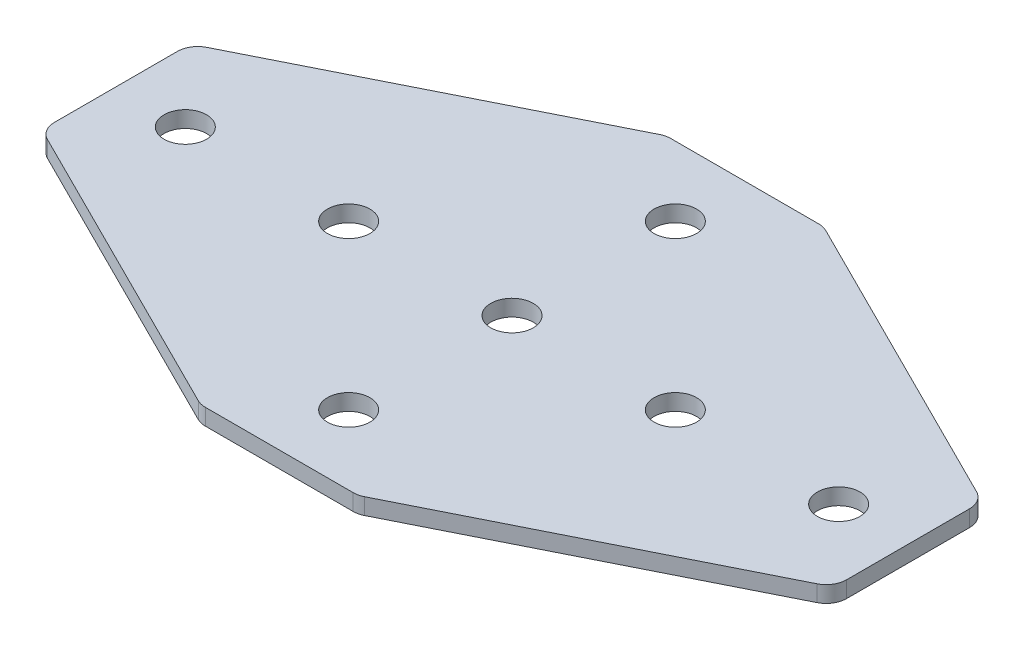
ISO-10303-21;
HEADER;
FILE_DESCRIPTION(('STEP AP214'),'2;1');
FILE_NAME('part.step','',(''),(''),'','','');
FILE_SCHEMA(('AUTOMOTIVE_DESIGN { 1 0 10303 214 1 1 1 1 }'));
ENDSEC;
DATA;
#1=APPLICATION_CONTEXT('core data for automotive mechanical design processes');
#2=APPLICATION_PROTOCOL_DEFINITION('international standard','automotive_design',2000,#1);
#3=PRODUCT_CONTEXT('',#1,'mechanical');
#4=PRODUCT('Part','Part','',(#3));
#5=PRODUCT_RELATED_PRODUCT_CATEGORY('part','',(#4));
#6=PRODUCT_DEFINITION_FORMATION('','',#4);
#7=PRODUCT_DEFINITION_CONTEXT('part definition',#1,'design');
#8=PRODUCT_DEFINITION('design','',#6,#7);
#9=PRODUCT_DEFINITION_SHAPE('','',#8);
#10=(LENGTH_UNIT() NAMED_UNIT(*) SI_UNIT(.MILLI.,.METRE.));
#11=(NAMED_UNIT(*) PLANE_ANGLE_UNIT() SI_UNIT($,.RADIAN.));
#12=(NAMED_UNIT(*) SI_UNIT($,.STERADIAN.) SOLID_ANGLE_UNIT());
#13=UNCERTAINTY_MEASURE_WITH_UNIT(LENGTH_MEASURE(1.E-05),#10,'distance_accuracy_value','');
#14=(GEOMETRIC_REPRESENTATION_CONTEXT(3) GLOBAL_UNCERTAINTY_ASSIGNED_CONTEXT((#13)) GLOBAL_UNIT_ASSIGNED_CONTEXT((#10,
#11,#12)) REPRESENTATION_CONTEXT('',''));
#15=CARTESIAN_POINT('',(0.,0.,0.));
#16=DIRECTION('',(0.,0.,1.));
#17=DIRECTION('',(1.,0.,0.));
#18=AXIS2_PLACEMENT_3D('',#15,#16,#17);
#19=CARTESIAN_POINT('',(-2.23293059684693,2.14126526075142,-0.907824161743065));
#20=DIRECTION('',(0.,-1.,0.));
#21=DIRECTION('',(0.,0.,-1.));
#22=AXIS2_PLACEMENT_3D('',#19,#20,#21);
#23=PLANE('',#22);
#24=CARTESIAN_POINT('',(-22.2329305968469,2.14126526075142,-0.90782416174305));
#25=DIRECTION('',(0.,-1.,0.));
#26=DIRECTION('',(0.,0.,1.));
#27=AXIS2_PLACEMENT_3D('',#24,#25,#26);
#28=CIRCLE('',#27,2.6);
#29=CARTESIAN_POINT('',(-22.2329305968469,2.14126526075142,1.69217583825695));
#30=VERTEX_POINT('',#29);
#31=EDGE_CURVE('E202',#30,#30,#28,.T.);
#32=ORIENTED_EDGE('',*,*,#31,.F.);
#33=EDGE_LOOP('',(#32));
#34=FACE_BOUND('',#33,.T.);
#35=CARTESIAN_POINT('',(-42.2329305968469,2.14126526075142,-0.907824161743056));
#36=DIRECTION('',(0.,-1.,0.));
#37=DIRECTION('',(0.,0.,1.));
#38=AXIS2_PLACEMENT_3D('',#35,#36,#37);
#39=CIRCLE('',#38,2.6);
#40=CARTESIAN_POINT('',(-42.2329305968469,2.14126526075142,1.69217583825694));
#41=VERTEX_POINT('',#40);
#42=EDGE_CURVE('E196',#41,#41,#39,.T.);
#43=ORIENTED_EDGE('',*,*,#42,.F.);
#44=EDGE_LOOP('',(#43));
#45=FACE_BOUND('',#44,.T.);
#46=CARTESIAN_POINT('',(-2.23293059684693,2.14126526075142,-0.907824161743065));
#47=DIRECTION('',(0.,1.,0.));
#48=DIRECTION('',(0.,0.,1.));
#49=AXIS2_PLACEMENT_3D('',#46,#47,#48);
#50=CIRCLE('',#49,2.6);
#51=CARTESIAN_POINT('',(-2.23293059684693,2.14126526075142,1.69217583825693));
#52=VERTEX_POINT('',#51);
#53=EDGE_CURVE('E230',#52,#52,#50,.T.);
#54=ORIENTED_EDGE('',*,*,#53,.T.);
#55=EDGE_LOOP('',(#54));
#56=FACE_BOUND('',#55,.T.);
#57=CARTESIAN_POINT('',(43.767069403153,2.14126526075142,-8.43568820674352));
#58=DIRECTION('',(0.,1.,0.));
#59=DIRECTION('',(0.,0.,1.));
#60=AXIS2_PLACEMENT_3D('',#57,#58,#59);
#61=CIRCLE('',#60,2.5);
#62=CARTESIAN_POINT('',(46.267069403153,2.14126526075142,-8.43568820674352));
#63=VERTEX_POINT('',#62);
#64=CARTESIAN_POINT('',(44.8851033919029,2.14126526075142,-10.6717561842433));
#65=VERTEX_POINT('',#64);
#66=EDGE_CURVE('E179',#63,#65,#61,.T.);
#67=ORIENTED_EDGE('',*,*,#66,.F.);
#68=DIRECTION('',(0.,0.,-1.));
#69=VECTOR('',#68,1.);
#70=CARTESIAN_POINT('',(46.267069403153,2.14126526075142,8.16512485513213));
#71=LINE('',#70,#69);
#72=CARTESIAN_POINT('',(46.267069403153,2.14126526075142,6.62003988325739));
#73=VERTEX_POINT('',#72);
#74=EDGE_CURVE('E242',#73,#63,#71,.T.);
#75=ORIENTED_EDGE('',*,*,#74,.F.);
#76=CARTESIAN_POINT('',(43.767069403153,2.14126526075142,6.62003988325739));
#77=DIRECTION('',(0.,-1.,0.));
#78=DIRECTION('',(0.,0.,-1.));
#79=AXIS2_PLACEMENT_3D('',#76,#77,#78);
#80=CIRCLE('',#79,2.5);
#81=CARTESIAN_POINT('',(44.8851033919029,2.14126526075142,8.85610786075718));
#82=VERTEX_POINT('',#81);
#83=EDGE_CURVE('E31',#73,#82,#80,.T.);
#84=ORIENTED_EDGE('',*,*,#83,.T.);
#85=DIRECTION('',(0.894427190999916,0.,-0.447213595499958));
#86=VECTOR('',#85,1.);
#87=CARTESIAN_POINT('',(7.41296743690345,2.14126526075142,27.5921758382569));
#88=LINE('',#87,#86);
#89=CARTESIAN_POINT('',(7.94083148190386,2.14126526075142,27.3282438157567));
#90=VERTEX_POINT('',#89);
#91=EDGE_CURVE('E239',#90,#82,#88,.T.);
#92=ORIENTED_EDGE('',*,*,#91,.F.);
#93=CARTESIAN_POINT('',(6.82279749315397,2.14126526075142,25.0921758382569));
#94=DIRECTION('',(0.,-1.,0.));
#95=DIRECTION('',(0.,0.,-1.));
#96=AXIS2_PLACEMENT_3D('',#93,#94,#95);
#97=CIRCLE('',#96,2.5);
#98=CARTESIAN_POINT('',(6.82279749315397,2.14126526075142,27.5921758382569));
#99=VERTEX_POINT('',#98);
#100=EDGE_CURVE('E273',#90,#99,#97,.T.);
#101=ORIENTED_EDGE('',*,*,#100,.T.);
#102=DIRECTION('',(1.,0.,0.));
#103=VECTOR('',#102,1.);
#104=CARTESIAN_POINT('',(-10.732930596847,2.14126526075142,27.5921758382569));
#105=LINE('',#104,#103);
#106=CARTESIAN_POINT('',(-11.2886586868478,2.14126526075142,27.5921758382569));
#107=VERTEX_POINT('',#106);
#108=EDGE_CURVE('E236',#107,#99,#105,.T.);
#109=ORIENTED_EDGE('',*,*,#108,.F.);
#110=CARTESIAN_POINT('',(-11.2886586868478,2.14126526075142,25.0921758382569));
#111=DIRECTION('',(0.,-1.,0.));
#112=DIRECTION('',(0.,0.,-1.));
#113=AXIS2_PLACEMENT_3D('',#110,#111,#112);
#114=CIRCLE('',#113,2.5);
#115=CARTESIAN_POINT('',(-12.4066926755977,2.14126526075142,27.3282438157567));
#116=VERTEX_POINT('',#115);
#117=EDGE_CURVE('E275',#107,#116,#114,.T.);
#118=ORIENTED_EDGE('',*,*,#117,.T.);
#119=DIRECTION('',(-0.894427190999916,0.,-0.447213595499958));
#120=VECTOR('',#119,1.);
#121=CARTESIAN_POINT('',(-11.8788286305973,2.14126526075142,27.5921758382569));
#122=LINE('',#121,#120);
#123=CARTESIAN_POINT('',(-49.3509645855968,2.14126526075142,8.8561078607572));
#124=VERTEX_POINT('',#123);
#125=EDGE_CURVE('E141',#116,#124,#122,.T.);
#126=ORIENTED_EDGE('',*,*,#125,.T.);
#127=CARTESIAN_POINT('',(-48.2329305968469,2.14126526075142,6.6200398832574));
#128=DIRECTION('',(0.,-1.,0.));
#129=DIRECTION('',(0.,0.,-1.));
#130=AXIS2_PLACEMENT_3D('',#127,#128,#129);
#131=CIRCLE('',#130,2.5);
#132=CARTESIAN_POINT('',(-50.7329305968469,2.14126526075142,6.6200398832574));
#133=VERTEX_POINT('',#132);
#134=EDGE_CURVE('E256',#124,#133,#131,.T.);
#135=ORIENTED_EDGE('',*,*,#134,.T.);
#136=DIRECTION('',(0.,0.,-1.));
#137=VECTOR('',#136,1.);
#138=CARTESIAN_POINT('',(-50.7329305968469,2.14126526075142,8.16512485513215));
#139=LINE('',#138,#137);
#140=CARTESIAN_POINT('',(-50.7329305968469,2.14126526075142,-8.43568820674354));
#141=VERTEX_POINT('',#140);
#142=EDGE_CURVE('E208',#133,#141,#139,.T.);
#143=ORIENTED_EDGE('',*,*,#142,.T.);
#144=CARTESIAN_POINT('',(-48.2329305968469,2.14126526075142,-8.43568820674353));
#145=DIRECTION('',(0.,1.,0.));
#146=DIRECTION('',(0.,0.,1.));
#147=AXIS2_PLACEMENT_3D('',#144,#145,#146);
#148=CIRCLE('',#147,2.5);
#149=CARTESIAN_POINT('',(-49.3509645855968,2.14126526075142,-10.6717561842433));
#150=VERTEX_POINT('',#149);
#151=EDGE_CURVE('E150',#150,#141,#148,.T.);
#152=ORIENTED_EDGE('',*,*,#151,.F.);
#153=DIRECTION('',(-0.894427190999916,0.,0.447213595499958));
#154=VECTOR('',#153,1.);
#155=CARTESIAN_POINT('',(-11.8788286305973,2.14126526075142,-29.407824161743));
#156=LINE('',#155,#154);
#157=CARTESIAN_POINT('',(-12.4066926755977,2.14126526075142,-29.1438921392428));
#158=VERTEX_POINT('',#157);
#159=EDGE_CURVE('E309',#158,#150,#156,.T.);
#160=ORIENTED_EDGE('',*,*,#159,.F.);
#161=CARTESIAN_POINT('',(-11.2886586868478,2.14126526075142,-26.907824161743));
#162=DIRECTION('',(0.,1.,0.));
#163=DIRECTION('',(0.,0.,1.));
#164=AXIS2_PLACEMENT_3D('',#161,#162,#163);
#165=CIRCLE('',#164,2.5);
#166=CARTESIAN_POINT('',(-11.2886586868478,2.14126526075142,-29.407824161743));
#167=VERTEX_POINT('',#166);
#168=EDGE_CURVE('E185',#167,#158,#165,.T.);
#169=ORIENTED_EDGE('',*,*,#168,.F.);
#170=DIRECTION('',(1.,0.,0.));
#171=VECTOR('',#170,1.);
#172=CARTESIAN_POINT('',(-10.732930596847,2.14126526075142,-29.407824161743));
#173=LINE('',#172,#171);
#174=CARTESIAN_POINT('',(6.82279749315397,2.14126526075142,-29.407824161743));
#175=VERTEX_POINT('',#174);
#176=EDGE_CURVE('E322',#167,#175,#173,.T.);
#177=ORIENTED_EDGE('',*,*,#176,.T.);
#178=CARTESIAN_POINT('',(6.82279749315397,2.14126526075142,-26.907824161743));
#179=DIRECTION('',(0.,1.,0.));
#180=DIRECTION('',(0.,0.,1.));
#181=AXIS2_PLACEMENT_3D('',#178,#179,#180);
#182=CIRCLE('',#181,2.5);
#183=CARTESIAN_POINT('',(7.94083148190386,2.14126526075142,-29.1438921392428));
#184=VERTEX_POINT('',#183);
#185=EDGE_CURVE('E182',#184,#175,#182,.T.);
#186=ORIENTED_EDGE('',*,*,#185,.F.);
#187=DIRECTION('',(0.894427190999916,0.,0.447213595499958));
#188=VECTOR('',#187,1.);
#189=CARTESIAN_POINT('',(7.41296743690345,2.14126526075142,-29.407824161743));
#190=LINE('',#189,#188);
#191=EDGE_CURVE('E151',#184,#65,#190,.T.);
#192=ORIENTED_EDGE('',*,*,#191,.T.);
#193=EDGE_LOOP('',(#67,#75,#84,#92,#101,#109,#118,#126,#135,#143,#152,#160,#169,#177,#186,#192));
#194=FACE_BOUND('',#193,.T.);
#195=CARTESIAN_POINT('',(37.7670694031531,2.14126526075142,-0.907824161743065));
#196=DIRECTION('',(0.,1.,0.));
#197=DIRECTION('',(0.,0.,1.));
#198=AXIS2_PLACEMENT_3D('',#195,#196,#197);
#199=CIRCLE('',#198,2.6);
#200=CARTESIAN_POINT('',(37.7670694031531,2.14126526075142,1.69217583825693));
#201=VERTEX_POINT('',#200);
#202=EDGE_CURVE('E212',#201,#201,#199,.T.);
#203=ORIENTED_EDGE('',*,*,#202,.T.);
#204=EDGE_LOOP('',(#203));
#205=FACE_BOUND('',#204,.T.);
#206=CARTESIAN_POINT('',(-2.23293059684694,2.14126526075142,19.0921758382569));
#207=DIRECTION('',(0.,1.,0.));
#208=DIRECTION('',(0.,0.,1.));
#209=AXIS2_PLACEMENT_3D('',#206,#207,#208);
#210=CIRCLE('',#209,2.6);
#211=CARTESIAN_POINT('',(-2.23293059684694,2.14126526075142,21.6921758382569));
#212=VERTEX_POINT('',#211);
#213=EDGE_CURVE('E218',#212,#212,#210,.T.);
#214=ORIENTED_EDGE('',*,*,#213,.T.);
#215=EDGE_LOOP('',(#214));
#216=FACE_BOUND('',#215,.T.);
#217=CARTESIAN_POINT('',(17.7670694031531,2.14126526075142,-0.907824161743054));
#218=DIRECTION('',(0.,1.,0.));
#219=DIRECTION('',(0.,0.,1.));
#220=AXIS2_PLACEMENT_3D('',#217,#218,#219);
#221=CIRCLE('',#220,2.6);
#222=CARTESIAN_POINT('',(17.7670694031531,2.14126526075142,1.69217583825694));
#223=VERTEX_POINT('',#222);
#224=EDGE_CURVE('E224',#223,#223,#221,.T.);
#225=ORIENTED_EDGE('',*,*,#224,.T.);
#226=EDGE_LOOP('',(#225));
#227=FACE_BOUND('',#226,.T.);
#228=CARTESIAN_POINT('',(-2.23293059684694,2.14126526075142,-20.9078241617431));
#229=DIRECTION('',(0.,-1.,0.));
#230=DIRECTION('',(0.,0.,-1.));
#231=AXIS2_PLACEMENT_3D('',#228,#229,#230);
#232=CIRCLE('',#231,2.6);
#233=CARTESIAN_POINT('',(-2.23293059684694,2.14126526075142,-23.5078241617431));
#234=VERTEX_POINT('',#233);
#235=EDGE_CURVE('E315',#234,#234,#232,.T.);
#236=ORIENTED_EDGE('',*,*,#235,.F.);
#237=EDGE_LOOP('',(#236));
#238=FACE_BOUND('',#237,.T.);
#239=ADVANCED_FACE('F16',(#34,#45,#56,#194,#205,#216,#227,#238),#23,.T.);
#240=CARTESIAN_POINT('',(46.267069403153,2.14126526075142,8.16512485513213));
#241=DIRECTION('',(1.,0.,0.));
#242=DIRECTION('',(0.,0.,-1.));
#243=AXIS2_PLACEMENT_3D('',#240,#241,#242);
#244=PLANE('',#243);
#245=ORIENTED_EDGE('',*,*,#74,.T.);
#246=DIRECTION('',(0.,1.,0.));
#247=VECTOR('',#246,1.);
#248=CARTESIAN_POINT('',(46.267069403153,2.14126526075142,-8.43568820674352));
#249=LINE('',#248,#247);
#250=CARTESIAN_POINT('',(46.267069403153,4.14126526075142,-8.43568820674352));
#251=VERTEX_POINT('',#250);
#252=EDGE_CURVE('E192',#251,#63,#249,.F.);
#253=ORIENTED_EDGE('',*,*,#252,.F.);
#254=DIRECTION('',(0.,0.,-1.));
#255=VECTOR('',#254,1.);
#256=CARTESIAN_POINT('',(46.267069403153,4.14126526075142,8.16512485513213));
#257=LINE('',#256,#255);
#258=CARTESIAN_POINT('',(46.267069403153,4.14126526075142,6.62003988325739));
#259=VERTEX_POINT('',#258);
#260=EDGE_CURVE('E240',#259,#251,#257,.T.);
#261=ORIENTED_EDGE('',*,*,#260,.F.);
#262=DIRECTION('',(0.,1.,0.));
#263=VECTOR('',#262,1.);
#264=CARTESIAN_POINT('',(46.267069403153,2.14126526075142,6.62003988325739));
#265=LINE('',#264,#263);
#266=EDGE_CURVE('E10',#259,#73,#265,.F.);
#267=ORIENTED_EDGE('',*,*,#266,.T.);
#268=EDGE_LOOP('',(#245,#253,#261,#267));
#269=FACE_BOUND('',#268,.T.);
#270=ADVANCED_FACE('F339',(#269),#244,.T.);
#271=CARTESIAN_POINT('',(-2.23293059684693,4.14126526075142,-0.907824161743065));
#272=DIRECTION('',(0.,-1.,0.));
#273=DIRECTION('',(0.,0.,-1.));
#274=AXIS2_PLACEMENT_3D('',#271,#272,#273);
#275=PLANE('',#274);
#276=CARTESIAN_POINT('',(-22.2329305968469,4.14126526075142,-0.90782416174305));
#277=DIRECTION('',(0.,-1.,0.));
#278=DIRECTION('',(0.,0.,1.));
#279=AXIS2_PLACEMENT_3D('',#276,#277,#278);
#280=CIRCLE('',#279,2.6);
#281=CARTESIAN_POINT('',(-22.2329305968469,4.14126526075142,1.69217583825695));
#282=VERTEX_POINT('',#281);
#283=EDGE_CURVE('E199',#282,#282,#280,.T.);
#284=ORIENTED_EDGE('',*,*,#283,.T.);
#285=EDGE_LOOP('',(#284));
#286=FACE_BOUND('',#285,.T.);
#287=CARTESIAN_POINT('',(-42.2329305968469,4.14126526075142,-0.907824161743056));
#288=DIRECTION('',(0.,-1.,0.));
#289=DIRECTION('',(0.,0.,1.));
#290=AXIS2_PLACEMENT_3D('',#287,#288,#289);
#291=CIRCLE('',#290,2.6);
#292=CARTESIAN_POINT('',(-42.2329305968469,4.14126526075142,1.69217583825694));
#293=VERTEX_POINT('',#292);
#294=EDGE_CURVE('E195',#293,#293,#291,.T.);
#295=ORIENTED_EDGE('',*,*,#294,.T.);
#296=EDGE_LOOP('',(#295));
#297=FACE_BOUND('',#296,.T.);
#298=CARTESIAN_POINT('',(-2.23293059684693,4.14126526075142,-0.907824161743065));
#299=DIRECTION('',(0.,1.,0.));
#300=DIRECTION('',(0.,0.,1.));
#301=AXIS2_PLACEMENT_3D('',#298,#299,#300);
#302=CIRCLE('',#301,2.6);
#303=CARTESIAN_POINT('',(-2.23293059684693,4.14126526075142,1.69217583825693));
#304=VERTEX_POINT('',#303);
#305=EDGE_CURVE('E227',#304,#304,#302,.T.);
#306=ORIENTED_EDGE('',*,*,#305,.F.);
#307=EDGE_LOOP('',(#306));
#308=FACE_BOUND('',#307,.T.);
#309=ORIENTED_EDGE('',*,*,#260,.T.);
#310=CARTESIAN_POINT('',(43.767069403153,4.14126526075142,-8.43568820674352));
#311=DIRECTION('',(0.,1.,0.));
#312=DIRECTION('',(0.,0.,1.));
#313=AXIS2_PLACEMENT_3D('',#310,#311,#312);
#314=CIRCLE('',#313,2.5);
#315=CARTESIAN_POINT('',(44.8851033919029,4.14126526075142,-10.6717561842433));
#316=VERTEX_POINT('',#315);
#317=EDGE_CURVE('E166',#316,#251,#314,.F.);
#318=ORIENTED_EDGE('',*,*,#317,.F.);
#319=DIRECTION('',(0.894427190999916,0.,0.447213595499958));
#320=VECTOR('',#319,1.);
#321=CARTESIAN_POINT('',(7.41296743690345,4.14126526075142,-29.407824161743));
#322=LINE('',#321,#320);
#323=CARTESIAN_POINT('',(7.94083148190386,4.14126526075142,-29.1438921392428));
#324=VERTEX_POINT('',#323);
#325=EDGE_CURVE('E324',#324,#316,#322,.T.);
#326=ORIENTED_EDGE('',*,*,#325,.F.);
#327=CARTESIAN_POINT('',(6.82279749315397,4.14126526075142,-26.907824161743));
#328=DIRECTION('',(0.,1.,0.));
#329=DIRECTION('',(0.,0.,1.));
#330=AXIS2_PLACEMENT_3D('',#327,#328,#329);
#331=CIRCLE('',#330,2.5);
#332=CARTESIAN_POINT('',(6.82279749315397,4.14126526075142,-29.407824161743));
#333=VERTEX_POINT('',#332);
#334=EDGE_CURVE('E169',#333,#324,#331,.F.);
#335=ORIENTED_EDGE('',*,*,#334,.F.);
#336=DIRECTION('',(1.,0.,0.));
#337=VECTOR('',#336,1.);
#338=CARTESIAN_POINT('',(-10.732930596847,4.14126526075142,-29.407824161743));
#339=LINE('',#338,#337);
#340=CARTESIAN_POINT('',(-11.2886586868478,4.14126526075142,-29.407824161743));
#341=VERTEX_POINT('',#340);
#342=EDGE_CURVE('E320',#341,#333,#339,.T.);
#343=ORIENTED_EDGE('',*,*,#342,.F.);
#344=CARTESIAN_POINT('',(-11.2886586868478,4.14126526075142,-26.907824161743));
#345=DIRECTION('',(0.,1.,0.));
#346=DIRECTION('',(0.,0.,1.));
#347=AXIS2_PLACEMENT_3D('',#344,#345,#346);
#348=CIRCLE('',#347,2.5);
#349=CARTESIAN_POINT('',(-12.4066926755977,4.14126526075142,-29.1438921392428));
#350=VERTEX_POINT('',#349);
#351=EDGE_CURVE('E172',#350,#341,#348,.F.);
#352=ORIENTED_EDGE('',*,*,#351,.F.);
#353=DIRECTION('',(-0.894427190999916,0.,0.447213595499958));
#354=VECTOR('',#353,1.);
#355=CARTESIAN_POINT('',(-11.8788286305973,4.14126526075142,-29.407824161743));
#356=LINE('',#355,#354);
#357=CARTESIAN_POINT('',(-49.3509645855968,4.14126526075142,-10.6717561842433));
#358=VERTEX_POINT('',#357);
#359=EDGE_CURVE('E157',#350,#358,#356,.T.);
#360=ORIENTED_EDGE('',*,*,#359,.T.);
#361=CARTESIAN_POINT('',(-48.2329305968469,4.14126526075142,-8.43568820674353));
#362=DIRECTION('',(0.,1.,0.));
#363=DIRECTION('',(0.,0.,1.));
#364=AXIS2_PLACEMENT_3D('',#361,#362,#363);
#365=CIRCLE('',#364,2.5);
#366=CARTESIAN_POINT('',(-50.7329305968469,4.14126526075142,-8.43568820674354));
#367=VERTEX_POINT('',#366);
#368=EDGE_CURVE('E147',#367,#358,#365,.F.);
#369=ORIENTED_EDGE('',*,*,#368,.F.);
#370=DIRECTION('',(0.,0.,-1.));
#371=VECTOR('',#370,1.);
#372=CARTESIAN_POINT('',(-50.7329305968469,4.14126526075142,8.16512485513215));
#373=LINE('',#372,#371);
#374=CARTESIAN_POINT('',(-50.7329305968469,4.14126526075142,6.6200398832574));
#375=VERTEX_POINT('',#374);
#376=EDGE_CURVE('E130',#375,#367,#373,.T.);
#377=ORIENTED_EDGE('',*,*,#376,.F.);
#378=CARTESIAN_POINT('',(-48.2329305968469,4.14126526075142,6.6200398832574));
#379=DIRECTION('',(0.,-1.,0.));
#380=DIRECTION('',(0.,0.,-1.));
#381=AXIS2_PLACEMENT_3D('',#378,#379,#380);
#382=CIRCLE('',#381,2.5);
#383=CARTESIAN_POINT('',(-49.3509645855968,4.14126526075142,8.8561078607572));
#384=VERTEX_POINT('',#383);
#385=EDGE_CURVE('E251',#375,#384,#382,.F.);
#386=ORIENTED_EDGE('',*,*,#385,.T.);
#387=DIRECTION('',(-0.894427190999916,0.,-0.447213595499958));
#388=VECTOR('',#387,1.);
#389=CARTESIAN_POINT('',(-11.8788286305973,4.14126526075142,27.5921758382569));
#390=LINE('',#389,#388);
#391=CARTESIAN_POINT('',(-12.4066926755977,4.14126526075142,27.3282438157567));
#392=VERTEX_POINT('',#391);
#393=EDGE_CURVE('E142',#392,#384,#390,.T.);
#394=ORIENTED_EDGE('',*,*,#393,.F.);
#395=CARTESIAN_POINT('',(-11.2886586868478,4.14126526075142,25.0921758382569));
#396=DIRECTION('',(0.,-1.,0.));
#397=DIRECTION('',(0.,0.,-1.));
#398=AXIS2_PLACEMENT_3D('',#395,#396,#397);
#399=CIRCLE('',#398,2.5);
#400=CARTESIAN_POINT('',(-11.2886586868478,4.14126526075142,27.5921758382569));
#401=VERTEX_POINT('',#400);
#402=EDGE_CURVE('E265',#392,#401,#399,.F.);
#403=ORIENTED_EDGE('',*,*,#402,.T.);
#404=DIRECTION('',(1.,0.,0.));
#405=VECTOR('',#404,1.);
#406=CARTESIAN_POINT('',(-10.732930596847,4.14126526075142,27.5921758382569));
#407=LINE('',#406,#405);
#408=CARTESIAN_POINT('',(6.82279749315397,4.14126526075142,27.5921758382569));
#409=VERTEX_POINT('',#408);
#410=EDGE_CURVE('E233',#401,#409,#407,.T.);
#411=ORIENTED_EDGE('',*,*,#410,.T.);
#412=CARTESIAN_POINT('',(6.82279749315397,4.14126526075142,25.0921758382569));
#413=DIRECTION('',(0.,-1.,0.));
#414=DIRECTION('',(0.,0.,-1.));
#415=AXIS2_PLACEMENT_3D('',#412,#413,#414);
#416=CIRCLE('',#415,2.5);
#417=CARTESIAN_POINT('',(7.94083148190386,4.14126526075142,27.3282438157567));
#418=VERTEX_POINT('',#417);
#419=EDGE_CURVE('E263',#409,#418,#416,.F.);
#420=ORIENTED_EDGE('',*,*,#419,.T.);
#421=DIRECTION('',(0.894427190999916,0.,-0.447213595499958));
#422=VECTOR('',#421,1.);
#423=CARTESIAN_POINT('',(7.41296743690345,4.14126526075142,27.5921758382569));
#424=LINE('',#423,#422);
#425=CARTESIAN_POINT('',(44.8851033919029,4.14126526075142,8.85610786075718));
#426=VERTEX_POINT('',#425);
#427=EDGE_CURVE('E246',#418,#426,#424,.T.);
#428=ORIENTED_EDGE('',*,*,#427,.T.);
#429=CARTESIAN_POINT('',(43.767069403153,4.14126526075142,6.62003988325739));
#430=DIRECTION('',(0.,-1.,0.));
#431=DIRECTION('',(0.,0.,-1.));
#432=AXIS2_PLACEMENT_3D('',#429,#430,#431);
#433=CIRCLE('',#432,2.5);
#434=EDGE_CURVE('E261',#426,#259,#433,.F.);
#435=ORIENTED_EDGE('',*,*,#434,.T.);
#436=EDGE_LOOP('',(#309,#318,#326,#335,#343,#352,#360,#369,#377,#386,#394,#403,#411,#420,#428,#435));
#437=FACE_BOUND('',#436,.T.);
#438=CARTESIAN_POINT('',(37.7670694031531,4.14126526075142,-0.907824161743065));
#439=DIRECTION('',(0.,1.,0.));
#440=DIRECTION('',(0.,0.,1.));
#441=AXIS2_PLACEMENT_3D('',#438,#439,#440);
#442=CIRCLE('',#441,2.6);
#443=CARTESIAN_POINT('',(37.7670694031531,4.14126526075142,1.69217583825693));
#444=VERTEX_POINT('',#443);
#445=EDGE_CURVE('E210',#444,#444,#442,.T.);
#446=ORIENTED_EDGE('',*,*,#445,.F.);
#447=EDGE_LOOP('',(#446));
#448=FACE_BOUND('',#447,.T.);
#449=CARTESIAN_POINT('',(-2.23293059684694,4.14126526075142,19.0921758382569));
#450=DIRECTION('',(0.,1.,0.));
#451=DIRECTION('',(0.,0.,1.));
#452=AXIS2_PLACEMENT_3D('',#449,#450,#451);
#453=CIRCLE('',#452,2.6);
#454=CARTESIAN_POINT('',(-2.23293059684694,4.14126526075142,21.6921758382569));
#455=VERTEX_POINT('',#454);
#456=EDGE_CURVE('E215',#455,#455,#453,.T.);
#457=ORIENTED_EDGE('',*,*,#456,.F.);
#458=EDGE_LOOP('',(#457));
#459=FACE_BOUND('',#458,.T.);
#460=CARTESIAN_POINT('',(17.7670694031531,4.14126526075142,-0.907824161743054));
#461=DIRECTION('',(0.,1.,0.));
#462=DIRECTION('',(0.,0.,1.));
#463=AXIS2_PLACEMENT_3D('',#460,#461,#462);
#464=CIRCLE('',#463,2.6);
#465=CARTESIAN_POINT('',(17.7670694031531,4.14126526075142,1.69217583825694));
#466=VERTEX_POINT('',#465);
#467=EDGE_CURVE('E221',#466,#466,#464,.T.);
#468=ORIENTED_EDGE('',*,*,#467,.F.);
#469=EDGE_LOOP('',(#468));
#470=FACE_BOUND('',#469,.T.);
#471=CARTESIAN_POINT('',(-2.23293059684694,4.14126526075142,-20.9078241617431));
#472=DIRECTION('',(0.,-1.,0.));
#473=DIRECTION('',(0.,0.,-1.));
#474=AXIS2_PLACEMENT_3D('',#471,#472,#473);
#475=CIRCLE('',#474,2.6);
#476=CARTESIAN_POINT('',(-2.23293059684694,4.14126526075142,-23.5078241617431));
#477=VERTEX_POINT('',#476);
#478=EDGE_CURVE('E312',#477,#477,#475,.T.);
#479=ORIENTED_EDGE('',*,*,#478,.T.);
#480=EDGE_LOOP('',(#479));
#481=FACE_BOUND('',#480,.T.);
#482=ADVANCED_FACE('F153',(#286,#297,#308,#437,#448,#459,#470,#481),#275,.F.);
#483=CARTESIAN_POINT('',(-2.23293059684693,2.14126526075142,-0.907824161743065));
#484=DIRECTION('',(0.,1.,0.));
#485=DIRECTION('',(0.,0.,1.));
#486=AXIS2_PLACEMENT_3D('',#483,#484,#485);
#487=CYLINDRICAL_SURFACE('',#486,2.6);
#488=ORIENTED_EDGE('',*,*,#53,.F.);
#489=EDGE_LOOP('',(#488));
#490=FACE_BOUND('',#489,.T.);
#491=ORIENTED_EDGE('',*,*,#305,.T.);
#492=EDGE_LOOP('',(#491));
#493=FACE_BOUND('',#492,.T.);
#494=ADVANCED_FACE('F481',(#490,#493),#487,.F.);
#495=CARTESIAN_POINT('',(17.7670694031531,2.14126526075142,-0.907824161743054));
#496=DIRECTION('',(0.,1.,0.));
#497=DIRECTION('',(0.,0.,1.));
#498=AXIS2_PLACEMENT_3D('',#495,#496,#497);
#499=CYLINDRICAL_SURFACE('',#498,2.6);
#500=ORIENTED_EDGE('',*,*,#467,.T.);
#501=EDGE_LOOP('',(#500));
#502=FACE_BOUND('',#501,.T.);
#503=ORIENTED_EDGE('',*,*,#224,.F.);
#504=EDGE_LOOP('',(#503));
#505=FACE_BOUND('',#504,.T.);
#506=ADVANCED_FACE('F474',(#502,#505),#499,.F.);
#507=CARTESIAN_POINT('',(37.7670694031531,2.14126526075142,-0.907824161743065));
#508=DIRECTION('',(0.,1.,0.));
#509=DIRECTION('',(0.,0.,1.));
#510=AXIS2_PLACEMENT_3D('',#507,#508,#509);
#511=CYLINDRICAL_SURFACE('',#510,2.6);
#512=ORIENTED_EDGE('',*,*,#445,.T.);
#513=EDGE_LOOP('',(#512));
#514=FACE_BOUND('',#513,.T.);
#515=ORIENTED_EDGE('',*,*,#202,.F.);
#516=EDGE_LOOP('',(#515));
#517=FACE_BOUND('',#516,.T.);
#518=ADVANCED_FACE('F469',(#514,#517),#511,.F.);
#519=CARTESIAN_POINT('',(-50.7329305968469,2.14126526075142,8.16512485513215));
#520=DIRECTION('',(-1.,0.,0.));
#521=DIRECTION('',(0.,0.,-1.));
#522=AXIS2_PLACEMENT_3D('',#519,#520,#521);
#523=PLANE('',#522);
#524=ORIENTED_EDGE('',*,*,#376,.T.);
#525=DIRECTION('',(0.,1.,0.));
#526=VECTOR('',#525,1.);
#527=CARTESIAN_POINT('',(-50.7329305968469,2.14126526075142,-8.43568820674354));
#528=LINE('',#527,#526);
#529=EDGE_CURVE('E134',#141,#367,#528,.T.);
#530=ORIENTED_EDGE('',*,*,#529,.F.);
#531=ORIENTED_EDGE('',*,*,#142,.F.);
#532=DIRECTION('',(0.,1.,0.));
#533=VECTOR('',#532,1.);
#534=CARTESIAN_POINT('',(-50.7329305968469,2.14126526075142,6.6200398832574));
#535=LINE('',#534,#533);
#536=EDGE_CURVE('E137',#133,#375,#535,.T.);
#537=ORIENTED_EDGE('',*,*,#536,.T.);
#538=EDGE_LOOP('',(#524,#530,#531,#537));
#539=FACE_BOUND('',#538,.T.);
#540=ADVANCED_FACE('F132',(#539),#523,.T.);
#541=CARTESIAN_POINT('',(-22.2329305968469,2.14126526075142,-0.90782416174305));
#542=DIRECTION('',(0.,1.,0.));
#543=DIRECTION('',(0.,0.,1.));
#544=AXIS2_PLACEMENT_3D('',#541,#542,#543);
#545=CYLINDRICAL_SURFACE('',#544,2.6);
#546=ORIENTED_EDGE('',*,*,#31,.T.);
#547=EDGE_LOOP('',(#546));
#548=FACE_BOUND('',#547,.T.);
#549=ORIENTED_EDGE('',*,*,#283,.F.);
#550=EDGE_LOOP('',(#549));
#551=FACE_BOUND('',#550,.T.);
#552=ADVANCED_FACE('F462',(#548,#551),#545,.F.);
#553=CARTESIAN_POINT('',(-42.2329305968469,2.14126526075142,-0.907824161743056));
#554=DIRECTION('',(0.,1.,0.));
#555=DIRECTION('',(0.,0.,1.));
#556=AXIS2_PLACEMENT_3D('',#553,#554,#555);
#557=CYLINDRICAL_SURFACE('',#556,2.6);
#558=ORIENTED_EDGE('',*,*,#294,.F.);
#559=EDGE_LOOP('',(#558));
#560=FACE_BOUND('',#559,.T.);
#561=ORIENTED_EDGE('',*,*,#42,.T.);
#562=EDGE_LOOP('',(#561));
#563=FACE_BOUND('',#562,.T.);
#564=ADVANCED_FACE('F459',(#560,#563),#557,.F.);
#565=CARTESIAN_POINT('',(7.41296743690345,2.14126526075142,27.5921758382569));
#566=DIRECTION('',(0.447213595499958,0.,0.894427190999916));
#567=DIRECTION('',(0.894427190999916,0.,-0.447213595499958));
#568=AXIS2_PLACEMENT_3D('',#565,#566,#567);
#569=PLANE('',#568);
#570=ORIENTED_EDGE('',*,*,#427,.F.);
#571=DIRECTION('',(0.,1.,0.));
#572=VECTOR('',#571,1.);
#573=CARTESIAN_POINT('',(7.94083148190386,2.14126526075142,27.3282438157567));
#574=LINE('',#573,#572);
#575=EDGE_CURVE('E24',#418,#90,#574,.F.);
#576=ORIENTED_EDGE('',*,*,#575,.T.);
#577=ORIENTED_EDGE('',*,*,#91,.T.);
#578=DIRECTION('',(0.,1.,0.));
#579=VECTOR('',#578,1.);
#580=CARTESIAN_POINT('',(44.8851033919029,2.14126526075142,8.85610786075718));
#581=LINE('',#580,#579);
#582=EDGE_CURVE('E277',#82,#426,#581,.T.);
#583=ORIENTED_EDGE('',*,*,#582,.T.);
#584=EDGE_LOOP('',(#570,#576,#577,#583));
#585=FACE_BOUND('',#584,.T.);
#586=ADVANCED_FACE('F280',(#585),#569,.T.);
#587=CARTESIAN_POINT('',(-10.732930596847,2.14126526075142,27.5921758382569));
#588=DIRECTION('',(0.,0.,1.));
#589=DIRECTION('',(1.,0.,0.));
#590=AXIS2_PLACEMENT_3D('',#587,#588,#589);
#591=PLANE('',#590);
#592=ORIENTED_EDGE('',*,*,#410,.F.);
#593=DIRECTION('',(0.,1.,0.));
#594=VECTOR('',#593,1.);
#595=CARTESIAN_POINT('',(-11.2886586868478,2.14126526075142,27.5921758382569));
#596=LINE('',#595,#594);
#597=EDGE_CURVE('E270',#401,#107,#596,.F.);
#598=ORIENTED_EDGE('',*,*,#597,.T.);
#599=ORIENTED_EDGE('',*,*,#108,.T.);
#600=DIRECTION('',(0.,1.,0.));
#601=VECTOR('',#600,1.);
#602=CARTESIAN_POINT('',(6.82279749315397,2.14126526075142,27.5921758382569));
#603=LINE('',#602,#601);
#604=EDGE_CURVE('E267',#99,#409,#603,.T.);
#605=ORIENTED_EDGE('',*,*,#604,.T.);
#606=EDGE_LOOP('',(#592,#598,#599,#605));
#607=FACE_BOUND('',#606,.T.);
#608=ADVANCED_FACE('F289',(#607),#591,.T.);
#609=CARTESIAN_POINT('',(-2.23293059684694,2.14126526075142,19.0921758382569));
#610=DIRECTION('',(0.,1.,0.));
#611=DIRECTION('',(0.,0.,1.));
#612=AXIS2_PLACEMENT_3D('',#609,#610,#611);
#613=CYLINDRICAL_SURFACE('',#612,2.6);
#614=ORIENTED_EDGE('',*,*,#456,.T.);
#615=EDGE_LOOP('',(#614));
#616=FACE_BOUND('',#615,.T.);
#617=ORIENTED_EDGE('',*,*,#213,.F.);
#618=EDGE_LOOP('',(#617));
#619=FACE_BOUND('',#618,.T.);
#620=ADVANCED_FACE('F471',(#616,#619),#613,.F.);
#621=CARTESIAN_POINT('',(-11.8788286305973,2.14126526075142,27.5921758382569));
#622=DIRECTION('',(-0.447213595499958,0.,0.894427190999916));
#623=DIRECTION('',(-0.894427190999916,0.,-0.447213595499958));
#624=AXIS2_PLACEMENT_3D('',#621,#622,#623);
#625=PLANE('',#624);
#626=ORIENTED_EDGE('',*,*,#125,.F.);
#627=DIRECTION('',(0.,1.,0.));
#628=VECTOR('',#627,1.);
#629=CARTESIAN_POINT('',(-12.4066926755977,2.14126526075142,27.3282438157567));
#630=LINE('',#629,#628);
#631=EDGE_CURVE('E258',#116,#392,#630,.T.);
#632=ORIENTED_EDGE('',*,*,#631,.T.);
#633=ORIENTED_EDGE('',*,*,#393,.T.);
#634=DIRECTION('',(0.,1.,0.));
#635=VECTOR('',#634,1.);
#636=CARTESIAN_POINT('',(-49.3509645855968,2.14126526075142,8.8561078607572));
#637=LINE('',#636,#635);
#638=EDGE_CURVE('E253',#384,#124,#637,.F.);
#639=ORIENTED_EDGE('',*,*,#638,.T.);
#640=EDGE_LOOP('',(#626,#632,#633,#639));
#641=FACE_BOUND('',#640,.T.);
#642=ADVANCED_FACE('F301',(#641),#625,.T.);
#643=CARTESIAN_POINT('',(-48.2329305968469,2.14126526075142,6.6200398832574));
#644=DIRECTION('',(0.,1.,0.));
#645=DIRECTION('',(0.,0.,1.));
#646=AXIS2_PLACEMENT_3D('',#643,#644,#645);
#647=CYLINDRICAL_SURFACE('',#646,2.5);
#648=ORIENTED_EDGE('',*,*,#134,.F.);
#649=ORIENTED_EDGE('',*,*,#638,.F.);
#650=ORIENTED_EDGE('',*,*,#385,.F.);
#651=ORIENTED_EDGE('',*,*,#536,.F.);
#652=EDGE_LOOP('',(#648,#649,#650,#651));
#653=FACE_BOUND('',#652,.T.);
#654=ADVANCED_FACE('F305',(#653),#647,.T.);
#655=CARTESIAN_POINT('',(-11.2886586868478,2.14126526075142,25.0921758382569));
#656=DIRECTION('',(0.,1.,0.));
#657=DIRECTION('',(0.,0.,1.));
#658=AXIS2_PLACEMENT_3D('',#655,#656,#657);
#659=CYLINDRICAL_SURFACE('',#658,2.5);
#660=ORIENTED_EDGE('',*,*,#117,.F.);
#661=ORIENTED_EDGE('',*,*,#597,.F.);
#662=ORIENTED_EDGE('',*,*,#402,.F.);
#663=ORIENTED_EDGE('',*,*,#631,.F.);
#664=EDGE_LOOP('',(#660,#661,#662,#663));
#665=FACE_BOUND('',#664,.T.);
#666=ADVANCED_FACE('F298',(#665),#659,.T.);
#667=CARTESIAN_POINT('',(6.82279749315397,2.14126526075142,25.0921758382569));
#668=DIRECTION('',(0.,1.,0.));
#669=DIRECTION('',(0.,0.,1.));
#670=AXIS2_PLACEMENT_3D('',#667,#668,#669);
#671=CYLINDRICAL_SURFACE('',#670,2.5);
#672=ORIENTED_EDGE('',*,*,#100,.F.);
#673=ORIENTED_EDGE('',*,*,#575,.F.);
#674=ORIENTED_EDGE('',*,*,#419,.F.);
#675=ORIENTED_EDGE('',*,*,#604,.F.);
#676=EDGE_LOOP('',(#672,#673,#674,#675));
#677=FACE_BOUND('',#676,.T.);
#678=ADVANCED_FACE('F287',(#677),#671,.T.);
#679=CARTESIAN_POINT('',(43.767069403153,2.14126526075142,6.62003988325739));
#680=DIRECTION('',(0.,1.,0.));
#681=DIRECTION('',(0.,0.,1.));
#682=AXIS2_PLACEMENT_3D('',#679,#680,#681);
#683=CYLINDRICAL_SURFACE('',#682,2.5);
#684=ORIENTED_EDGE('',*,*,#83,.F.);
#685=ORIENTED_EDGE('',*,*,#266,.F.);
#686=ORIENTED_EDGE('',*,*,#434,.F.);
#687=ORIENTED_EDGE('',*,*,#582,.F.);
#688=EDGE_LOOP('',(#684,#685,#686,#687));
#689=FACE_BOUND('',#688,.T.);
#690=ADVANCED_FACE('F18',(#689),#683,.T.);
#691=CARTESIAN_POINT('',(7.41296743690345,2.14126526075142,-29.407824161743));
#692=DIRECTION('',(0.447213595499958,0.,-0.894427190999916));
#693=DIRECTION('',(0.894427190999916,0.,0.447213595499958));
#694=AXIS2_PLACEMENT_3D('',#691,#692,#693);
#695=PLANE('',#694);
#696=ORIENTED_EDGE('',*,*,#325,.T.);
#697=DIRECTION('',(0.,1.,0.));
#698=VECTOR('',#697,1.);
#699=CARTESIAN_POINT('',(44.8851033919029,2.14126526075142,-10.6717561842433));
#700=LINE('',#699,#698);
#701=EDGE_CURVE('E188',#65,#316,#700,.T.);
#702=ORIENTED_EDGE('',*,*,#701,.F.);
#703=ORIENTED_EDGE('',*,*,#191,.F.);
#704=DIRECTION('',(0.,1.,0.));
#705=VECTOR('',#704,1.);
#706=CARTESIAN_POINT('',(7.94083148190386,2.14126526075142,-29.1438921392428));
#707=LINE('',#706,#705);
#708=EDGE_CURVE('E190',#324,#184,#707,.F.);
#709=ORIENTED_EDGE('',*,*,#708,.F.);
#710=EDGE_LOOP('',(#696,#702,#703,#709));
#711=FACE_BOUND('',#710,.T.);
#712=ADVANCED_FACE('F332',(#711),#695,.T.);
#713=CARTESIAN_POINT('',(-10.732930596847,2.14126526075142,-29.407824161743));
#714=DIRECTION('',(0.,0.,-1.));
#715=DIRECTION('',(1.,0.,0.));
#716=AXIS2_PLACEMENT_3D('',#713,#714,#715);
#717=PLANE('',#716);
#718=ORIENTED_EDGE('',*,*,#342,.T.);
#719=DIRECTION('',(0.,1.,0.));
#720=VECTOR('',#719,1.);
#721=CARTESIAN_POINT('',(6.82279749315397,2.14126526075142,-29.407824161743));
#722=LINE('',#721,#720);
#723=EDGE_CURVE('E175',#175,#333,#722,.T.);
#724=ORIENTED_EDGE('',*,*,#723,.F.);
#725=ORIENTED_EDGE('',*,*,#176,.F.);
#726=DIRECTION('',(0.,1.,0.));
#727=VECTOR('',#726,1.);
#728=CARTESIAN_POINT('',(-11.2886586868478,2.14126526075142,-29.407824161743));
#729=LINE('',#728,#727);
#730=EDGE_CURVE('E177',#341,#167,#729,.F.);
#731=ORIENTED_EDGE('',*,*,#730,.F.);
#732=EDGE_LOOP('',(#718,#724,#725,#731));
#733=FACE_BOUND('',#732,.T.);
#734=ADVANCED_FACE('F347',(#733),#717,.T.);
#735=CARTESIAN_POINT('',(-2.23293059684694,2.14126526075142,-20.9078241617431));
#736=DIRECTION('',(0.,1.,0.));
#737=DIRECTION('',(0.,0.,-1.));
#738=AXIS2_PLACEMENT_3D('',#735,#736,#737);
#739=CYLINDRICAL_SURFACE('',#738,2.6);
#740=ORIENTED_EDGE('',*,*,#478,.F.);
#741=EDGE_LOOP('',(#740));
#742=FACE_BOUND('',#741,.T.);
#743=ORIENTED_EDGE('',*,*,#235,.T.);
#744=EDGE_LOOP('',(#743));
#745=FACE_BOUND('',#744,.T.);
#746=ADVANCED_FACE('F397',(#742,#745),#739,.F.);
#747=CARTESIAN_POINT('',(-11.8788286305973,2.14126526075142,-29.407824161743));
#748=DIRECTION('',(-0.447213595499958,0.,-0.894427190999916));
#749=DIRECTION('',(-0.894427190999916,0.,0.447213595499958));
#750=AXIS2_PLACEMENT_3D('',#747,#748,#749);
#751=PLANE('',#750);
#752=ORIENTED_EDGE('',*,*,#159,.T.);
#753=DIRECTION('',(0.,1.,0.));
#754=VECTOR('',#753,1.);
#755=CARTESIAN_POINT('',(-49.3509645855968,2.14126526075142,-10.6717561842433));
#756=LINE('',#755,#754);
#757=EDGE_CURVE('E158',#358,#150,#756,.F.);
#758=ORIENTED_EDGE('',*,*,#757,.F.);
#759=ORIENTED_EDGE('',*,*,#359,.F.);
#760=DIRECTION('',(0.,1.,0.));
#761=VECTOR('',#760,1.);
#762=CARTESIAN_POINT('',(-12.4066926755977,2.14126526075142,-29.1438921392428));
#763=LINE('',#762,#761);
#764=EDGE_CURVE('E164',#158,#350,#763,.T.);
#765=ORIENTED_EDGE('',*,*,#764,.F.);
#766=EDGE_LOOP('',(#752,#758,#759,#765));
#767=FACE_BOUND('',#766,.T.);
#768=ADVANCED_FACE('F407',(#767),#751,.T.);
#769=CARTESIAN_POINT('',(-48.2329305968469,2.14126526075142,-8.43568820674353));
#770=DIRECTION('',(0.,1.,0.));
#771=DIRECTION('',(0.,0.,-1.));
#772=AXIS2_PLACEMENT_3D('',#769,#770,#771);
#773=CYLINDRICAL_SURFACE('',#772,2.5);
#774=ORIENTED_EDGE('',*,*,#151,.T.);
#775=ORIENTED_EDGE('',*,*,#529,.T.);
#776=ORIENTED_EDGE('',*,*,#368,.T.);
#777=ORIENTED_EDGE('',*,*,#757,.T.);
#778=EDGE_LOOP('',(#774,#775,#776,#777));
#779=FACE_BOUND('',#778,.T.);
#780=ADVANCED_FACE('F146',(#779),#773,.T.);
#781=CARTESIAN_POINT('',(-11.2886586868478,2.14126526075142,-26.907824161743));
#782=DIRECTION('',(0.,1.,0.));
#783=DIRECTION('',(0.,0.,-1.));
#784=AXIS2_PLACEMENT_3D('',#781,#782,#783);
#785=CYLINDRICAL_SURFACE('',#784,2.5);
#786=ORIENTED_EDGE('',*,*,#168,.T.);
#787=ORIENTED_EDGE('',*,*,#764,.T.);
#788=ORIENTED_EDGE('',*,*,#351,.T.);
#789=ORIENTED_EDGE('',*,*,#730,.T.);
#790=EDGE_LOOP('',(#786,#787,#788,#789));
#791=FACE_BOUND('',#790,.T.);
#792=ADVANCED_FACE('F425',(#791),#785,.T.);
#793=CARTESIAN_POINT('',(6.82279749315397,2.14126526075142,-26.907824161743));
#794=DIRECTION('',(0.,1.,0.));
#795=DIRECTION('',(0.,0.,-1.));
#796=AXIS2_PLACEMENT_3D('',#793,#794,#795);
#797=CYLINDRICAL_SURFACE('',#796,2.5);
#798=ORIENTED_EDGE('',*,*,#185,.T.);
#799=ORIENTED_EDGE('',*,*,#723,.T.);
#800=ORIENTED_EDGE('',*,*,#334,.T.);
#801=ORIENTED_EDGE('',*,*,#708,.T.);
#802=EDGE_LOOP('',(#798,#799,#800,#801));
#803=FACE_BOUND('',#802,.T.);
#804=ADVANCED_FACE('F434',(#803),#797,.T.);
#805=CARTESIAN_POINT('',(43.767069403153,2.14126526075142,-8.43568820674352));
#806=DIRECTION('',(0.,1.,0.));
#807=DIRECTION('',(0.,0.,-1.));
#808=AXIS2_PLACEMENT_3D('',#805,#806,#807);
#809=CYLINDRICAL_SURFACE('',#808,2.5);
#810=ORIENTED_EDGE('',*,*,#66,.T.);
#811=ORIENTED_EDGE('',*,*,#701,.T.);
#812=ORIENTED_EDGE('',*,*,#317,.T.);
#813=ORIENTED_EDGE('',*,*,#252,.T.);
#814=EDGE_LOOP('',(#810,#811,#812,#813));
#815=FACE_BOUND('',#814,.T.);
#816=ADVANCED_FACE('F337',(#815),#809,.T.);
#817=CLOSED_SHELL('',(#239,#270,#482,#494,#506,#518,#540,#552,#564,#586,#608,#620,#642,#654,
#666,#678,#690,#712,#734,#746,#768,#780,#792,#804,#816));
#818=MANIFOLD_SOLID_BREP('B1',#817);
#819=ADVANCED_BREP_SHAPE_REPRESENTATION('',(#18,#818),#14);
#820=SHAPE_DEFINITION_REPRESENTATION(#9,#819);
ENDSEC;
END-ISO-10303-21;
